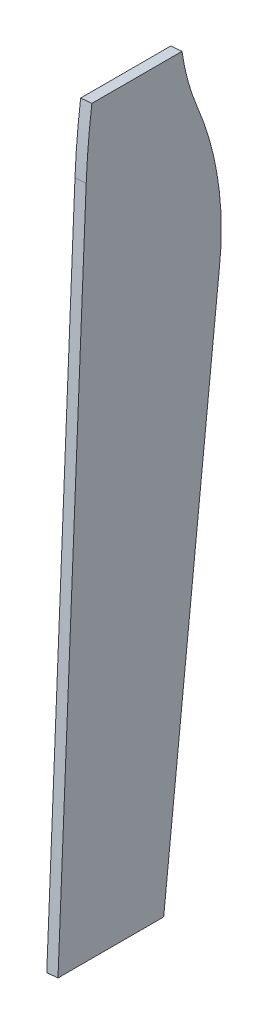
ISO-10303-21;
HEADER;
FILE_DESCRIPTION(('STEP AP214'),'2;1');
FILE_NAME('part.step','',(''),(''),'','','');
FILE_SCHEMA(('AUTOMOTIVE_DESIGN { 1 0 10303 214 1 1 1 1 }'));
ENDSEC;
DATA;
#1=APPLICATION_CONTEXT('core data for automotive mechanical design processes');
#2=APPLICATION_PROTOCOL_DEFINITION('international standard','automotive_design',2000,#1);
#3=PRODUCT_CONTEXT('',#1,'mechanical');
#4=PRODUCT('Part','Part','',(#3));
#5=PRODUCT_RELATED_PRODUCT_CATEGORY('part','',(#4));
#6=PRODUCT_DEFINITION_FORMATION('','',#4);
#7=PRODUCT_DEFINITION_CONTEXT('part definition',#1,'design');
#8=PRODUCT_DEFINITION('design','',#6,#7);
#9=PRODUCT_DEFINITION_SHAPE('','',#8);
#10=(LENGTH_UNIT() NAMED_UNIT(*) SI_UNIT(.MILLI.,.METRE.));
#11=(NAMED_UNIT(*) PLANE_ANGLE_UNIT() SI_UNIT($,.RADIAN.));
#12=(NAMED_UNIT(*) SI_UNIT($,.STERADIAN.) SOLID_ANGLE_UNIT());
#13=UNCERTAINTY_MEASURE_WITH_UNIT(LENGTH_MEASURE(1.E-05),#10,'distance_accuracy_value','');
#14=(GEOMETRIC_REPRESENTATION_CONTEXT(3) GLOBAL_UNCERTAINTY_ASSIGNED_CONTEXT((#13)) GLOBAL_UNIT_ASSIGNED_CONTEXT((#10,
#11,#12)) REPRESENTATION_CONTEXT('',''));
#15=CARTESIAN_POINT('',(0.,0.,0.));
#16=DIRECTION('',(0.,0.,1.));
#17=DIRECTION('',(1.,0.,0.));
#18=AXIS2_PLACEMENT_3D('',#15,#16,#17);
#19=CARTESIAN_POINT('',(187.987061396378,27.2696737290519,-57.7034556856869));
#20=DIRECTION('',(0.996194698091746,0.0871557427476585,0.));
#21=DIRECTION('',(-0.0871557427476585,0.996194698091746,0.));
#22=AXIS2_PLACEMENT_3D('',#19,#20,#21);
#23=PLANE('',#22);
#24=DIRECTION('',(0.,0.,1.));
#25=VECTOR('',#24,1.);
#26=CARTESIAN_POINT('',(192.21394671327,-21.0438465207966,-42.816199294546));
#27=LINE('',#26,#25);
#28=CARTESIAN_POINT('',(192.21394671327,-21.0438465207966,-42.816199294546));
#29=VERTEX_POINT('',#28);
#30=CARTESIAN_POINT('',(192.21394671327,-21.0438465207966,-57.8161992945459));
#31=VERTEX_POINT('',#30);
#32=EDGE_CURVE('E116',#29,#31,#27,.F.);
#33=ORIENTED_EDGE('',*,*,#32,.F.);
#34=DIRECTION('',(0.0864007779746376,-0.987565411249426,0.131337215095836));
#35=VECTOR('',#34,1.);
#36=CARTESIAN_POINT('',(184.517142039935,66.9310334595642,-54.5160579605081));
#37=LINE('',#36,#35);
#38=CARTESIAN_POINT('',(184.517142039935,66.9310334595637,-54.516057960508));
#39=VERTEX_POINT('',#38);
#40=EDGE_CURVE('E117',#39,#29,#37,.T.);
#41=ORIENTED_EDGE('',*,*,#40,.F.);
#42=CARTESIAN_POINT('',(185.60784217498,54.4642738693627,-148.97502675162));
#43=DIRECTION('',(0.996194698091746,0.0871557427476587,0.));
#44=DIRECTION('',(-0.0871557427476587,0.996194698091746,0.));
#45=AXIS2_PLACEMENT_3D('',#42,#43,#44);
#46=CIRCLE('',#45,95.2843455481791);
#47=CARTESIAN_POINT('',(183.760176079486,75.5831939789006,-56.0789350687546));
#48=VERTEX_POINT('',#47);
#49=EDGE_CURVE('E140',#48,#39,#46,.T.);
#50=ORIENTED_EDGE('',*,*,#49,.F.);
#51=DIRECTION('',(0.,0.,1.));
#52=VECTOR('',#51,1.);
#53=CARTESIAN_POINT('',(183.760176079486,75.5831939789005,-68.8632412815567));
#54=LINE('',#53,#52);
#55=CARTESIAN_POINT('',(183.760176079486,75.5831939789005,-68.8632412815567));
#56=VERTEX_POINT('',#55);
#57=EDGE_CURVE('E92',#56,#48,#54,.T.);
#58=ORIENTED_EDGE('',*,*,#57,.F.);
#59=CARTESIAN_POINT('',(183.606137383649,77.3438643289717,-95.4436680680885));
#60=DIRECTION('',(0.996194698091746,0.0871557427476587,0.));
#61=DIRECTION('',(-0.0871557427476587,0.996194698091746,0.));
#62=AXIS2_PLACEMENT_3D('',#59,#60,#61);
#63=CIRCLE('',#62,26.6391211595955);
#64=CARTESIAN_POINT('',(184.402719268997,68.2388917160151,-70.4215237320638));
#65=VERTEX_POINT('',#64);
#66=EDGE_CURVE('E90',#56,#65,#63,.T.);
#67=ORIENTED_EDGE('',*,*,#66,.T.);
#68=CARTESIAN_POINT('',(185.471340733546,56.0244924843626,-36.8541014514823));
#69=DIRECTION('',(0.996194698091746,0.0871557427476587,0.));
#70=DIRECTION('',(-0.0871557427476587,0.996194698091746,0.));
#71=AXIS2_PLACEMENT_3D('',#68,#69,#70);
#72=CIRCLE('',#71,35.7366106253456);
#73=CARTESIAN_POINT('',(186.128115097609,48.5175271520124,-71.7871733296048));
#74=VERTEX_POINT('',#73);
#75=EDGE_CURVE('E23',#74,#65,#72,.T.);
#76=ORIENTED_EDGE('',*,*,#75,.F.);
#77=DIRECTION('',(-0.0854619284736453,0.976834312348714,-0.196191195010837));
#78=VECTOR('',#77,1.);
#79=CARTESIAN_POINT('',(192.21394671327,-21.0438465207966,-57.8161992945459));
#80=LINE('',#79,#78);
#81=EDGE_CURVE('E88',#31,#74,#80,.T.);
#82=ORIENTED_EDGE('',*,*,#81,.F.);
#83=EDGE_LOOP('',(#33,#41,#50,#58,#67,#76,#82));
#84=FACE_BOUND('',#83,.T.);
#85=ADVANCED_FACE('F20',(#84),#23,.F.);
#86=CARTESIAN_POINT('',(192.21394671327,-21.0438465207966,-57.8161992945459));
#87=DIRECTION('',(0.0170991893217202,-0.195444628282079,-0.980565660728653));
#88=DIRECTION('',(0.,0.980709042180627,-0.195473206821697));
#89=AXIS2_PLACEMENT_3D('',#86,#87,#88);
#90=PLANE('',#89);
#91=DIRECTION('',(-0.085461929184902,0.976834320478312,-0.196191154223803));
#92=VECTOR('',#91,1.);
#93=CARTESIAN_POINT('',(193.807858230217,-20.9043973324004,-57.8161992945459));
#94=LINE('',#93,#92);
#95=CARTESIAN_POINT('',(193.807858230217,-20.9043973324004,-57.8161992945459));
#96=VERTEX_POINT('',#95);
#97=CARTESIAN_POINT('',(187.722026601893,48.6569764851363,-71.7871726034828));
#98=VERTEX_POINT('',#97);
#99=EDGE_CURVE('E139',#96,#98,#94,.T.);
#100=ORIENTED_EDGE('',*,*,#99,.F.);
#101=DIRECTION('',(0.996194698091746,0.0871557427476587,0.));
#102=VECTOR('',#101,1.);
#103=CARTESIAN_POINT('',(192.21394671327,-21.0438465207966,-57.8161992945459));
#104=LINE('',#103,#102);
#105=EDGE_CURVE('E112',#31,#96,#104,.T.);
#106=ORIENTED_EDGE('',*,*,#105,.F.);
#107=ORIENTED_EDGE('',*,*,#81,.T.);
#108=DIRECTION('',(0.996194698091746,0.0871557427476587,0.));
#109=VECTOR('',#108,1.);
#110=CARTESIAN_POINT('',(186.128115084947,48.5175272967417,-71.7871726034832));
#111=LINE('',#110,#109);
#112=EDGE_CURVE('E86',#98,#74,#111,.F.);
#113=ORIENTED_EDGE('',*,*,#112,.F.);
#114=EDGE_LOOP('',(#100,#106,#107,#113));
#115=FACE_BOUND('',#114,.T.);
#116=ADVANCED_FACE('F177',(#115),#90,.T.);
#117=CARTESIAN_POINT('',(185.471340733546,56.0244924843626,-36.8541014514823));
#118=DIRECTION('',(0.996194698091746,0.0871557427476587,0.));
#119=DIRECTION('',(-0.0871557427476587,0.996194698091746,0.));
#120=AXIS2_PLACEMENT_3D('',#117,#118,#119);
#121=CYLINDRICAL_SURFACE('',#120,35.7366106253456);
#122=CARTESIAN_POINT('',(187.065252250492,56.1639416727588,-36.8541014514823));
#123=DIRECTION('',(0.996194698091746,0.0871557427476587,0.));
#124=DIRECTION('',(-0.0871557427476587,0.996194698091746,0.));
#125=AXIS2_PLACEMENT_3D('',#122,#123,#124);
#126=CIRCLE('',#125,35.7366106253456);
#127=CARTESIAN_POINT('',(185.996630785943,68.3783409044114,-70.4215237320637));
#128=VERTEX_POINT('',#127);
#129=EDGE_CURVE('E135',#98,#128,#126,.T.);
#130=ORIENTED_EDGE('',*,*,#129,.F.);
#131=ORIENTED_EDGE('',*,*,#112,.T.);
#132=ORIENTED_EDGE('',*,*,#75,.T.);
#133=DIRECTION('',(0.996194698091746,0.0871557427476587,0.));
#134=VECTOR('',#133,1.);
#135=CARTESIAN_POINT('',(184.402719268997,68.2388917160151,-70.4215237320638));
#136=LINE('',#135,#134);
#137=EDGE_CURVE('E84',#65,#128,#136,.T.);
#138=ORIENTED_EDGE('',*,*,#137,.T.);
#139=EDGE_LOOP('',(#130,#131,#132,#138));
#140=FACE_BOUND('',#139,.T.);
#141=ADVANCED_FACE('F82',(#140),#121,.T.);
#142=CARTESIAN_POINT('',(183.606137383649,77.3438643289717,-95.4436680680885));
#143=DIRECTION('',(0.996194698091746,0.0871557427476587,0.));
#144=DIRECTION('',(-0.0871557427476587,0.996194698091746,0.));
#145=AXIS2_PLACEMENT_3D('',#142,#143,#144);
#146=CYLINDRICAL_SURFACE('',#145,26.6391211595955);
#147=DIRECTION('',(-0.996194698091746,-0.0871557427476587,0.));
#148=VECTOR('',#147,1.);
#149=CARTESIAN_POINT('',(183.760176079486,75.5831939789005,-68.8632412815567));
#150=LINE('',#149,#148);
#151=CARTESIAN_POINT('',(185.354087596433,75.7226431672968,-68.8632412815567));
#152=VERTEX_POINT('',#151);
#153=EDGE_CURVE('E108',#152,#56,#150,.T.);
#154=ORIENTED_EDGE('',*,*,#153,.F.);
#155=CARTESIAN_POINT('',(185.200048900595,77.4833135173679,-95.4436680680885));
#156=DIRECTION('',(0.996194698091746,0.0871557427476587,0.));
#157=DIRECTION('',(-0.0871557427476587,0.996194698091746,0.));
#158=AXIS2_PLACEMENT_3D('',#155,#156,#157);
#159=CIRCLE('',#158,26.6391211595955);
#160=EDGE_CURVE('E98',#128,#152,#159,.F.);
#161=ORIENTED_EDGE('',*,*,#160,.F.);
#162=ORIENTED_EDGE('',*,*,#137,.F.);
#163=ORIENTED_EDGE('',*,*,#66,.F.);
#164=EDGE_LOOP('',(#154,#161,#162,#163));
#165=FACE_BOUND('',#164,.T.);
#166=ADVANCED_FACE('F96',(#165),#146,.F.);
#167=CARTESIAN_POINT('',(183.760176079486,75.5831939789005,-68.8632412815567));
#168=DIRECTION('',(-0.0871557427476587,0.996194698091746,0.));
#169=DIRECTION('',(-0.996194698091746,-0.0871557427476587,0.));
#170=AXIS2_PLACEMENT_3D('',#167,#168,#169);
#171=PLANE('',#170);
#172=DIRECTION('',(0.,0.,1.));
#173=VECTOR('',#172,1.);
#174=CARTESIAN_POINT('',(185.354087596433,75.7226431672968,-57.7034556856869));
#175=LINE('',#174,#173);
#176=CARTESIAN_POINT('',(185.354087596433,75.7226431672969,-56.0789350687547));
#177=VERTEX_POINT('',#176);
#178=EDGE_CURVE('E133',#152,#177,#175,.T.);
#179=ORIENTED_EDGE('',*,*,#178,.F.);
#180=ORIENTED_EDGE('',*,*,#153,.T.);
#181=ORIENTED_EDGE('',*,*,#57,.T.);
#182=DIRECTION('',(0.996194698091746,0.0871557427476587,0.));
#183=VECTOR('',#182,1.);
#184=CARTESIAN_POINT('',(183.760176079487,75.5831939789007,-56.0789350687547));
#185=LINE('',#184,#183);
#186=EDGE_CURVE('E121',#177,#48,#185,.F.);
#187=ORIENTED_EDGE('',*,*,#186,.F.);
#188=EDGE_LOOP('',(#179,#180,#181,#187));
#189=FACE_BOUND('',#188,.T.);
#190=ADVANCED_FACE('F172',(#189),#171,.T.);
#191=CARTESIAN_POINT('',(185.607842174981,54.4642738693628,-148.97502675162));
#192=DIRECTION('',(0.996194698091746,0.0871557427476587,0.));
#193=DIRECTION('',(-0.0871557427476587,0.996194698091746,0.));
#194=AXIS2_PLACEMENT_3D('',#191,#192,#193);
#195=CYLINDRICAL_SURFACE('',#194,95.2843455481791);
#196=CARTESIAN_POINT('',(187.201753691928,54.603723057759,-148.97502675162));
#197=DIRECTION('',(0.996194698091746,0.0871557427476587,0.));
#198=DIRECTION('',(-0.0871557427476587,0.996194698091746,0.));
#199=AXIS2_PLACEMENT_3D('',#196,#197,#198);
#200=CIRCLE('',#199,95.2843455481791);
#201=CARTESIAN_POINT('',(186.111053556882,67.07048264796,-54.516057960508));
#202=VERTEX_POINT('',#201);
#203=EDGE_CURVE('E128',#177,#202,#200,.T.);
#204=ORIENTED_EDGE('',*,*,#203,.F.);
#205=ORIENTED_EDGE('',*,*,#186,.T.);
#206=ORIENTED_EDGE('',*,*,#49,.T.);
#207=DIRECTION('',(-0.996194698091749,-0.0871557427476154,0.));
#208=VECTOR('',#207,1.);
#209=CARTESIAN_POINT('',(186.111053556882,67.0704826479604,-54.5160579605081));
#210=LINE('',#209,#208);
#211=EDGE_CURVE('E120',#202,#39,#210,.T.);
#212=ORIENTED_EDGE('',*,*,#211,.F.);
#213=EDGE_LOOP('',(#204,#205,#206,#212));
#214=FACE_BOUND('',#213,.T.);
#215=ADVANCED_FACE('F181',(#214),#195,.T.);
#216=CARTESIAN_POINT('',(184.517142039935,66.9310334595642,-54.5160579605081));
#217=DIRECTION('',(-0.0114467925320866,0.130837437340607,0.991337750683827));
#218=DIRECTION('',(0.,-0.991402704093432,0.130846009936227));
#219=AXIS2_PLACEMENT_3D('',#216,#217,#218);
#220=PLANE('',#219);
#221=DIRECTION('',(0.0864007779746421,-0.987565411249425,0.131337215095836));
#222=VECTOR('',#221,1.);
#223=CARTESIAN_POINT('',(186.111053556882,67.0704826479604,-54.5160579605081));
#224=LINE('',#223,#222);
#225=CARTESIAN_POINT('',(193.807858230217,-20.9043973324004,-42.816199294546));
#226=VERTEX_POINT('',#225);
#227=EDGE_CURVE('E30',#202,#226,#224,.T.);
#228=ORIENTED_EDGE('',*,*,#227,.F.);
#229=ORIENTED_EDGE('',*,*,#211,.T.);
#230=ORIENTED_EDGE('',*,*,#40,.T.);
#231=DIRECTION('',(0.996194698091746,0.0871557427476587,0.));
#232=VECTOR('',#231,1.);
#233=CARTESIAN_POINT('',(192.21394671327,-21.0438465207966,-42.816199294546));
#234=LINE('',#233,#232);
#235=EDGE_CURVE('E39',#226,#29,#234,.F.);
#236=ORIENTED_EDGE('',*,*,#235,.F.);
#237=EDGE_LOOP('',(#228,#229,#230,#236));
#238=FACE_BOUND('',#237,.T.);
#239=ADVANCED_FACE('F180',(#238),#220,.T.);
#240=CARTESIAN_POINT('',(192.21394671327,-21.0438465207966,-42.816199294546));
#241=DIRECTION('',(0.0871557427476587,-0.996194698091746,0.));
#242=DIRECTION('',(0.996194698091746,0.0871557427476587,0.));
#243=AXIS2_PLACEMENT_3D('',#240,#241,#242);
#244=PLANE('',#243);
#245=DIRECTION('',(0.,0.,1.));
#246=VECTOR('',#245,1.);
#247=CARTESIAN_POINT('',(193.807858230217,-20.9043973324004,-57.7034556856869));
#248=LINE('',#247,#246);
#249=EDGE_CURVE('E12',#226,#96,#248,.F.);
#250=ORIENTED_EDGE('',*,*,#249,.F.);
#251=ORIENTED_EDGE('',*,*,#235,.T.);
#252=ORIENTED_EDGE('',*,*,#32,.T.);
#253=ORIENTED_EDGE('',*,*,#105,.T.);
#254=EDGE_LOOP('',(#250,#251,#252,#253));
#255=FACE_BOUND('',#254,.T.);
#256=ADVANCED_FACE('F179',(#255),#244,.T.);
#257=CARTESIAN_POINT('',(189.580972913325,27.4091229174482,-57.7034556856869));
#258=DIRECTION('',(0.996194698091746,0.0871557427476585,0.));
#259=DIRECTION('',(-0.0871557427476585,0.996194698091746,0.));
#260=AXIS2_PLACEMENT_3D('',#257,#258,#259);
#261=PLANE('',#260);
#262=ORIENTED_EDGE('',*,*,#227,.T.);
#263=ORIENTED_EDGE('',*,*,#249,.T.);
#264=ORIENTED_EDGE('',*,*,#99,.T.);
#265=ORIENTED_EDGE('',*,*,#129,.T.);
#266=ORIENTED_EDGE('',*,*,#160,.T.);
#267=ORIENTED_EDGE('',*,*,#178,.T.);
#268=ORIENTED_EDGE('',*,*,#203,.T.);
#269=EDGE_LOOP('',(#262,#263,#264,#265,#266,#267,#268));
#270=FACE_BOUND('',#269,.T.);
#271=ADVANCED_FACE('F174',(#270),#261,.T.);
#272=CLOSED_SHELL('',(#85,#116,#141,#166,#190,#215,#239,#256,#271));
#273=MANIFOLD_SOLID_BREP('B1',#272);
#274=ADVANCED_BREP_SHAPE_REPRESENTATION('',(#18,#273),#14);
#275=SHAPE_DEFINITION_REPRESENTATION(#9,#274);
ENDSEC;
END-ISO-10303-21;
